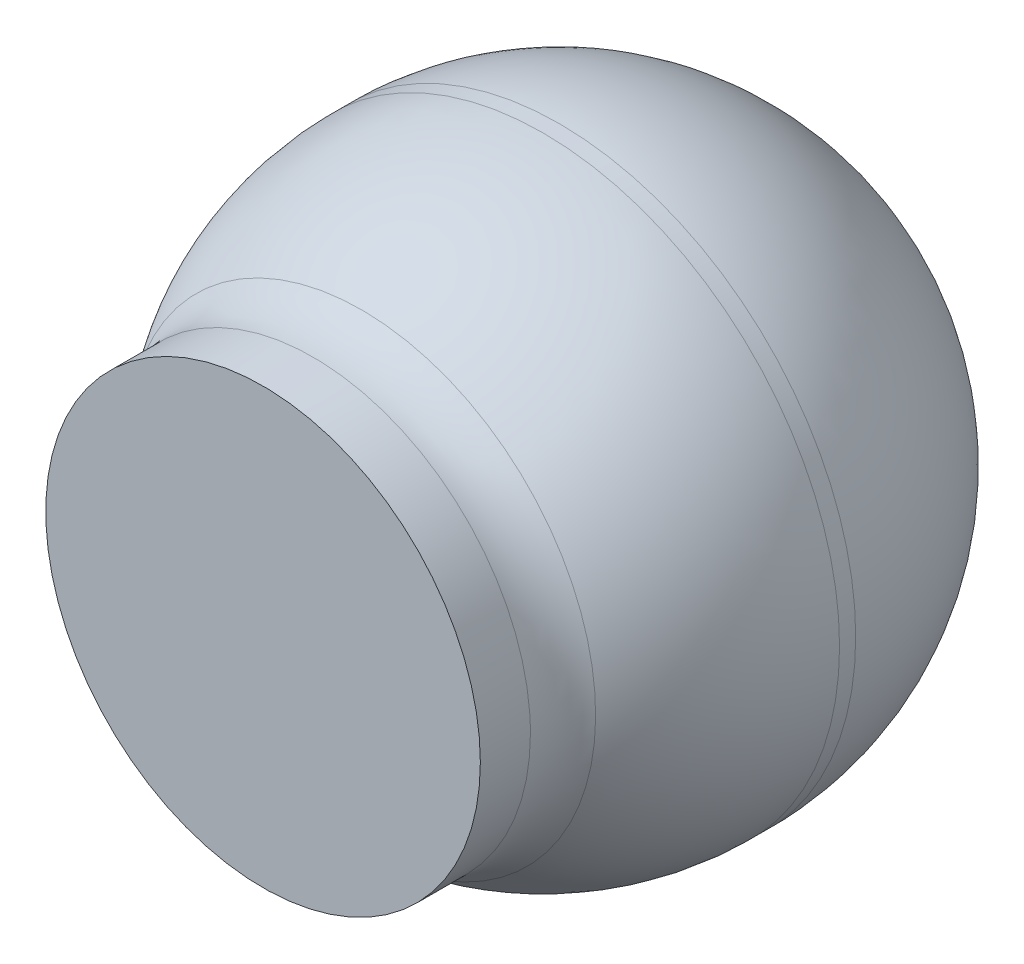
ISO-10303-21;
HEADER;
FILE_DESCRIPTION(('STEP AP214'),'2;1');
FILE_NAME('part.step','',(''),(''),'','','');
FILE_SCHEMA(('AUTOMOTIVE_DESIGN { 1 0 10303 214 1 1 1 1 }'));
ENDSEC;
DATA;
#1=APPLICATION_CONTEXT('core data for automotive mechanical design processes');
#2=APPLICATION_PROTOCOL_DEFINITION('international standard','automotive_design',2000,#1);
#3=PRODUCT_CONTEXT('',#1,'mechanical');
#4=PRODUCT('Part','Part','',(#3));
#5=PRODUCT_RELATED_PRODUCT_CATEGORY('part','',(#4));
#6=PRODUCT_DEFINITION_FORMATION('','',#4);
#7=PRODUCT_DEFINITION_CONTEXT('part definition',#1,'design');
#8=PRODUCT_DEFINITION('design','',#6,#7);
#9=PRODUCT_DEFINITION_SHAPE('','',#8);
#10=(LENGTH_UNIT() NAMED_UNIT(*) SI_UNIT(.MILLI.,.METRE.));
#11=(NAMED_UNIT(*) PLANE_ANGLE_UNIT() SI_UNIT($,.RADIAN.));
#12=(NAMED_UNIT(*) SI_UNIT($,.STERADIAN.) SOLID_ANGLE_UNIT());
#13=UNCERTAINTY_MEASURE_WITH_UNIT(LENGTH_MEASURE(1.E-05),#10,'distance_accuracy_value','');
#14=(GEOMETRIC_REPRESENTATION_CONTEXT(3) GLOBAL_UNCERTAINTY_ASSIGNED_CONTEXT((#13)) GLOBAL_UNIT_ASSIGNED_CONTEXT((#10,
#11,#12)) REPRESENTATION_CONTEXT('',''));
#15=CARTESIAN_POINT('',(0.,0.,0.));
#16=DIRECTION('',(0.,0.,1.));
#17=DIRECTION('',(1.,0.,0.));
#18=AXIS2_PLACEMENT_3D('',#15,#16,#17);
#19=CARTESIAN_POINT('',(-9.452919922269,-6.591349291452,10.006534503384));
#20=DIRECTION('',(0.,0.,-1.));
#21=DIRECTION('',(-1.,0.,0.));
#22=AXIS2_PLACEMENT_3D('',#19,#20,#21);
#23=PLANE('',#22);
#24=CARTESIAN_POINT('',(-9.452919922269,-6.591349291452,10.006534503384));
#25=DIRECTION('',(0.,0.,1.));
#26=DIRECTION('',(1.,0.,0.));
#27=AXIS2_PLACEMENT_3D('',#24,#25,#26);
#28=CIRCLE('',#27,0.275);
#29=CARTESIAN_POINT('',(-9.177919922269,-6.591349291452,10.006534503384));
#30=VERTEX_POINT('',#29);
#31=EDGE_CURVE('E20',#30,#30,#28,.F.);
#32=ORIENTED_EDGE('',*,*,#31,.F.);
#33=EDGE_LOOP('',(#32));
#34=FACE_BOUND('',#33,.T.);
#35=ADVANCED_FACE('F17',(#34),#23,.F.);
#36=CARTESIAN_POINT('',(-9.452919922269,-6.591349291452,9.906534503384));
#37=DIRECTION('',(0.,0.,1.));
#38=DIRECTION('',(1.,0.,0.));
#39=AXIS2_PLACEMENT_3D('',#36,#37,#38);
#40=CYLINDRICAL_SURFACE('',#39,0.275);
#41=CARTESIAN_POINT('',(-9.452919922269,-6.591349291452,9.943180457728));
#42=DIRECTION('',(0.,0.,-1.));
#43=DIRECTION('',(0.996700902337583,0.0811622527992436,0.));
#44=AXIS2_PLACEMENT_3D('',#41,#42,#43);
#45=CIRCLE('',#44,0.275000000000001);
#46=CARTESIAN_POINT('',(-9.17882717412617,-6.56902967193221,9.943180457728));
#47=VERTEX_POINT('',#46);
#48=EDGE_CURVE('E65',#47,#47,#45,.F.);
#49=ORIENTED_EDGE('',*,*,#48,.T.);
#50=EDGE_LOOP('',(#49));
#51=FACE_BOUND('',#50,.T.);
#52=ORIENTED_EDGE('',*,*,#31,.T.);
#53=EDGE_LOOP('',(#52));
#54=FACE_BOUND('',#53,.T.);
#55=ADVANCED_FACE('F62',(#51,#54),#40,.T.);
#56=CARTESIAN_POINT('',(-9.452919922269,-6.591349291452,9.943180457728));
#57=DIRECTION('',(0.,0.,-1.));
#58=DIRECTION('',(0.996700902337583,0.0811622527992448,0.));
#59=AXIS2_PLACEMENT_3D('',#56,#57,#58);
#60=TOROIDAL_SURFACE('',#59,0.375,0.1);
#61=ORIENTED_EDGE('',*,*,#48,.F.);
#62=EDGE_LOOP('',(#61));
#63=FACE_BOUND('',#62,.T.);
#64=CARTESIAN_POINT('',(-9.452919922269,-6.591349291452,9.881744931236));
#65=DIRECTION('',(0.,0.,-1.));
#66=DIRECTION('',(-0.996700902337598,-0.0811622527990598,0.));
#67=AXIS2_PLACEMENT_3D('',#64,#65,#66);
#68=CIRCLE('',#67,0.296097046412663);
#69=CARTESIAN_POINT('',(-9.748040115608,-6.615381194786,9.881744931236));
#70=VERTEX_POINT('',#69);
#71=EDGE_CURVE('E39',#70,#70,#68,.T.);
#72=ORIENTED_EDGE('',*,*,#71,.F.);
#73=EDGE_LOOP('',(#72));
#74=FACE_BOUND('',#73,.T.);
#75=ADVANCED_FACE('F57',(#63,#74),#60,.F.);
#76=CARTESIAN_POINT('',(-9.826682760645,-6.621785136252,9.651976062157));
#77=CARTESIAN_POINT('',(-9.826682760645,-6.621785136252,9.701461392103));
#78=CARTESIAN_POINT('',(-9.818526217348,-6.621120941579,9.750947004335));
#79=CARTESIAN_POINT('',(-9.802207085349,-6.619792059952,9.798626332798));
#80=CARTESIAN_POINT('',(-9.778341390838,-6.617848654938,9.842699544317));
#81=CARTESIAN_POINT('',(-9.748040115608,-6.615381194786,9.881744931236));
#82=(BOUNDED_CURVE() B_SPLINE_CURVE(5,(#76,#77,#78,#79,#80,#81),.UNSPECIFIED.,.F.,
.F.) B_SPLINE_CURVE_WITH_KNOTS((6,6),(0.,0.661568582165),
.UNSPECIFIED.) CURVE() GEOMETRIC_REPRESENTATION_ITEM() RATIONAL_B_SPLINE_CURVE((1.,1.,1.,1.,1.,1.)) REPRESENTATION_ITEM(''));
#83=CARTESIAN_POINT('',(-9.452919922269,-6.591349291452,9.651976062157));
#84=DIRECTION('',(0.,0.,-1.));
#85=AXIS1_PLACEMENT('',#83,#84);
#86=SURFACE_OF_REVOLUTION('',#82,#85);
#87=CARTESIAN_POINT('',(-9.452919922269,-6.591349291452,9.651976062157));
#88=DIRECTION('',(0.,0.,1.));
#89=DIRECTION('',(1.,0.,0.));
#90=AXIS2_PLACEMENT_3D('',#87,#88,#89);
#91=CIRCLE('',#90,0.375);
#92=CARTESIAN_POINT('',(-9.077919922269,-6.591349291452,9.651976062157));
#93=VERTEX_POINT('',#92);
#94=EDGE_CURVE('E36',#93,#93,#91,.F.);
#95=ORIENTED_EDGE('',*,*,#94,.F.);
#96=EDGE_LOOP('',(#95));
#97=FACE_BOUND('',#96,.T.);
#98=ORIENTED_EDGE('',*,*,#71,.T.);
#99=EDGE_LOOP('',(#98));
#100=FACE_BOUND('',#99,.T.);
#101=ADVANCED_FACE('F53',(#97,#100),#86,.F.);
#102=CARTESIAN_POINT('',(-9.452919922269,-6.591349291452,9.256534503384));
#103=DIRECTION('',(0.,0.,1.));
#104=DIRECTION('',(1.,0.,0.));
#105=AXIS2_PLACEMENT_3D('',#102,#103,#104);
#106=CYLINDRICAL_SURFACE('',#105,0.375);
#107=CARTESIAN_POINT('',(-9.452919922269,-6.591349291452,9.631534503384));
#108=DIRECTION('',(0.,0.,-1.));
#109=DIRECTION('',(0.0811622527992357,-0.996700902337583,0.));
#110=AXIS2_PLACEMENT_3D('',#107,#108,#109);
#111=CIRCLE('',#110,0.375);
#112=CARTESIAN_POINT('',(-9.42248407746929,-6.96511212982859,9.631534503384));
#113=VERTEX_POINT('',#112);
#114=CARTESIAN_POINT('',(-9.48335576706871,-6.21758645307541,9.631534503384));
#115=VERTEX_POINT('',#114);
#116=EDGE_CURVE('E11',#113,#115,#111,.T.);
#117=ORIENTED_EDGE('',*,*,#116,.F.);
#118=CARTESIAN_POINT('',(-9.452919922269,-6.591349291452,9.631534503384));
#119=DIRECTION('',(0.,0.,1.));
#120=DIRECTION('',(0.0811622527992365,-0.996700902337583,0.));
#121=AXIS2_PLACEMENT_3D('',#118,#119,#120);
#122=CIRCLE('',#121,0.375);
#123=EDGE_CURVE('E25',#115,#113,#122,.F.);
#124=ORIENTED_EDGE('',*,*,#123,.F.);
#125=EDGE_LOOP('',(#117,#124));
#126=FACE_BOUND('',#125,.T.);
#127=ORIENTED_EDGE('',*,*,#94,.T.);
#128=EDGE_LOOP('',(#127));
#129=FACE_BOUND('',#128,.T.);
#130=ADVANCED_FACE('F34',(#126,#129),#106,.T.);
#131=CARTESIAN_POINT('',(-9.452919922269,-6.591349291452,9.631534503384));
#132=DIRECTION('',(0.0811622527992361,-0.996700902337583,0.));
#133=DIRECTION('',(-0.996700902337583,-0.0811622527992361,0.));
#134=AXIS2_PLACEMENT_3D('',#131,#132,#133);
#135=SPHERICAL_SURFACE('',#134,0.375);
#136=ORIENTED_EDGE('',*,*,#123,.T.);
#137=ORIENTED_EDGE('',*,*,#116,.T.);
#138=EDGE_LOOP('',(#136,#137));
#139=FACE_BOUND('',#138,.T.);
#140=ADVANCED_FACE('F32',(#139),#135,.T.);
#141=CLOSED_SHELL('',(#35,#55,#75,#101,#130,#140));
#142=MANIFOLD_SOLID_BREP('B1',#141);
#143=ADVANCED_BREP_SHAPE_REPRESENTATION('',(#18,#142),#14);
#144=SHAPE_DEFINITION_REPRESENTATION(#9,#143);
ENDSEC;
END-ISO-10303-21;
